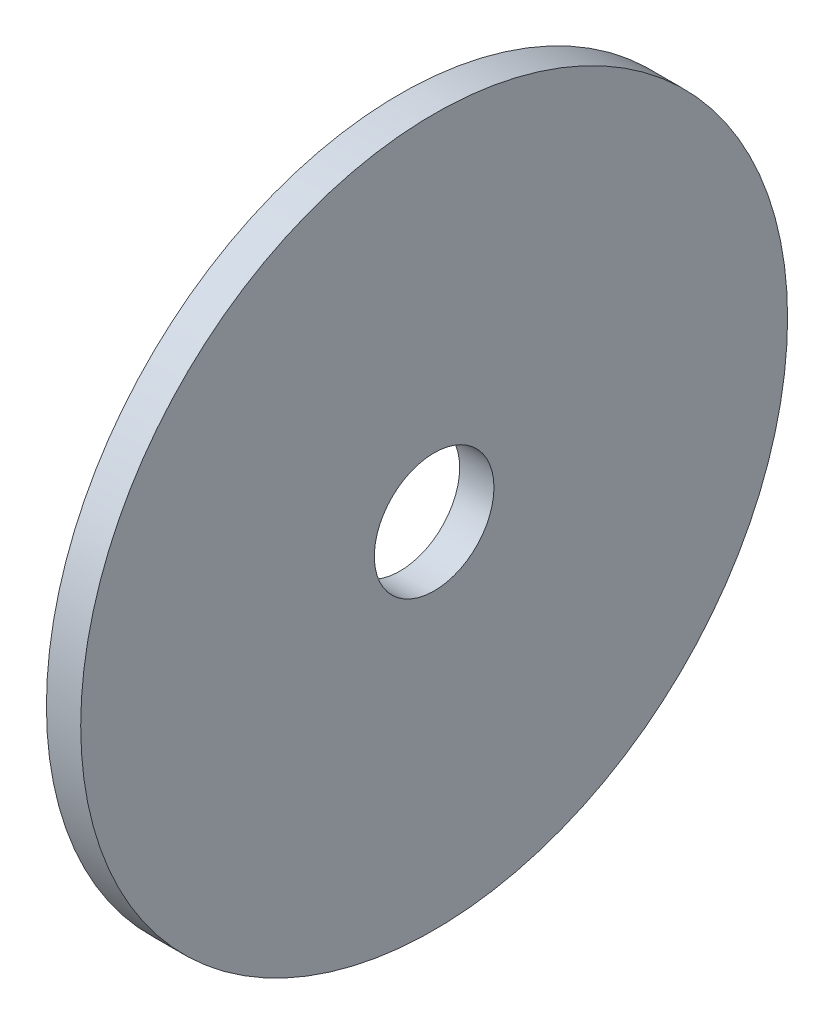
ISO-10303-21;
HEADER;
FILE_DESCRIPTION(('STEP AP214'),'2;1');
FILE_NAME('part.step','',(''),(''),'','','');
FILE_SCHEMA(('AUTOMOTIVE_DESIGN { 1 0 10303 214 1 1 1 1 }'));
ENDSEC;
DATA;
#1=APPLICATION_CONTEXT('core data for automotive mechanical design processes');
#2=APPLICATION_PROTOCOL_DEFINITION('international standard','automotive_design',2000,#1);
#3=PRODUCT_CONTEXT('',#1,'mechanical');
#4=PRODUCT('Part','Part','',(#3));
#5=PRODUCT_RELATED_PRODUCT_CATEGORY('part','',(#4));
#6=PRODUCT_DEFINITION_FORMATION('','',#4);
#7=PRODUCT_DEFINITION_CONTEXT('part definition',#1,'design');
#8=PRODUCT_DEFINITION('design','',#6,#7);
#9=PRODUCT_DEFINITION_SHAPE('','',#8);
#10=(LENGTH_UNIT() NAMED_UNIT(*) SI_UNIT(.MILLI.,.METRE.));
#11=(NAMED_UNIT(*) PLANE_ANGLE_UNIT() SI_UNIT($,.RADIAN.));
#12=(NAMED_UNIT(*) SI_UNIT($,.STERADIAN.) SOLID_ANGLE_UNIT());
#13=UNCERTAINTY_MEASURE_WITH_UNIT(LENGTH_MEASURE(1.E-05),#10,'distance_accuracy_value','');
#14=(GEOMETRIC_REPRESENTATION_CONTEXT(3) GLOBAL_UNCERTAINTY_ASSIGNED_CONTEXT((#13)) GLOBAL_UNIT_ASSIGNED_CONTEXT((#10,
#11,#12)) REPRESENTATION_CONTEXT('',''));
#15=CARTESIAN_POINT('',(0.,0.,0.));
#16=DIRECTION('',(0.,0.,1.));
#17=DIRECTION('',(1.,0.,0.));
#18=AXIS2_PLACEMENT_3D('',#15,#16,#17);
#19=CARTESIAN_POINT('',(547.878,0.,0.));
#20=DIRECTION('',(1.,0.,0.));
#21=DIRECTION('',(0.,0.,-1.));
#22=AXIS2_PLACEMENT_3D('',#19,#20,#21);
#23=PLANE('',#22);
#24=CARTESIAN_POINT('',(547.878,0.,0.));
#25=DIRECTION('',(1.,0.,0.));
#26=DIRECTION('',(0.,0.,-1.));
#27=AXIS2_PLACEMENT_3D('',#24,#25,#26);
#28=CIRCLE('',#27,9.525);
#29=CARTESIAN_POINT('',(547.878,0.,-9.525));
#30=VERTEX_POINT('',#29);
#31=EDGE_CURVE('E59',#30,#30,#28,.T.);
#32=ORIENTED_EDGE('',*,*,#31,.T.);
#33=EDGE_LOOP('',(#32));
#34=FACE_BOUND('',#33,.T.);
#35=CARTESIAN_POINT('',(547.878,0.,0.));
#36=DIRECTION('',(1.,0.,0.));
#37=DIRECTION('',(0.,0.,-1.));
#38=AXIS2_PLACEMENT_3D('',#35,#36,#37);
#39=CIRCLE('',#38,56.287467029387);
#40=CARTESIAN_POINT('',(547.878,0.,-56.287467029387));
#41=VERTEX_POINT('',#40);
#42=EDGE_CURVE('E11',#41,#41,#39,.T.);
#43=ORIENTED_EDGE('',*,*,#42,.F.);
#44=EDGE_LOOP('',(#43));
#45=FACE_BOUND('',#44,.T.);
#46=ADVANCED_FACE('F46',(#34,#45),#23,.F.);
#47=CARTESIAN_POINT('',(547.878,0.,0.));
#48=DIRECTION('',(1.,0.,0.));
#49=DIRECTION('',(0.,0.,-1.));
#50=AXIS2_PLACEMENT_3D('',#47,#48,#49);
#51=CYLINDRICAL_SURFACE('',#50,56.287467029387);
#52=ORIENTED_EDGE('',*,*,#42,.T.);
#53=EDGE_LOOP('',(#52));
#54=FACE_BOUND('',#53,.T.);
#55=CARTESIAN_POINT('',(553.339,0.,0.));
#56=DIRECTION('',(1.,0.,0.));
#57=DIRECTION('',(0.,0.,-1.));
#58=AXIS2_PLACEMENT_3D('',#55,#56,#57);
#59=CIRCLE('',#58,56.287467029387);
#60=CARTESIAN_POINT('',(553.339,0.,-56.287467029387));
#61=VERTEX_POINT('',#60);
#62=EDGE_CURVE('E50',#61,#61,#59,.T.);
#63=ORIENTED_EDGE('',*,*,#62,.F.);
#64=EDGE_LOOP('',(#63));
#65=FACE_BOUND('',#64,.T.);
#66=ADVANCED_FACE('F79',(#54,#65),#51,.T.);
#67=CARTESIAN_POINT('',(553.339,0.,0.));
#68=DIRECTION('',(1.,0.,0.));
#69=DIRECTION('',(0.,0.,-1.));
#70=AXIS2_PLACEMENT_3D('',#67,#68,#69);
#71=PLANE('',#70);
#72=CARTESIAN_POINT('',(553.339,0.,0.));
#73=DIRECTION('',(1.,0.,0.));
#74=DIRECTION('',(0.,0.,-1.));
#75=AXIS2_PLACEMENT_3D('',#72,#73,#74);
#76=CIRCLE('',#75,9.525);
#77=CARTESIAN_POINT('',(553.339,0.,-9.525));
#78=VERTEX_POINT('',#77);
#79=EDGE_CURVE('E61',#78,#78,#76,.T.);
#80=ORIENTED_EDGE('',*,*,#79,.F.);
#81=EDGE_LOOP('',(#80));
#82=FACE_BOUND('',#81,.T.);
#83=ORIENTED_EDGE('',*,*,#62,.T.);
#84=EDGE_LOOP('',(#83));
#85=FACE_BOUND('',#84,.T.);
#86=ADVANCED_FACE('F48',(#82,#85),#71,.T.);
#87=CARTESIAN_POINT('',(547.878,0.,0.));
#88=DIRECTION('',(1.,0.,0.));
#89=DIRECTION('',(0.,0.,-1.));
#90=AXIS2_PLACEMENT_3D('',#87,#88,#89);
#91=CYLINDRICAL_SURFACE('',#90,9.525);
#92=ORIENTED_EDGE('',*,*,#31,.F.);
#93=EDGE_LOOP('',(#92));
#94=FACE_BOUND('',#93,.T.);
#95=ORIENTED_EDGE('',*,*,#79,.T.);
#96=EDGE_LOOP('',(#95));
#97=FACE_BOUND('',#96,.T.);
#98=ADVANCED_FACE('F71',(#94,#97),#91,.F.);
#99=CLOSED_SHELL('',(#46,#66,#86,#98));
#100=MANIFOLD_SOLID_BREP('B2',#99);
#101=ADVANCED_BREP_SHAPE_REPRESENTATION('',(#18,#100),#14);
#102=SHAPE_DEFINITION_REPRESENTATION(#9,#101);
ENDSEC;
END-ISO-10303-21;
